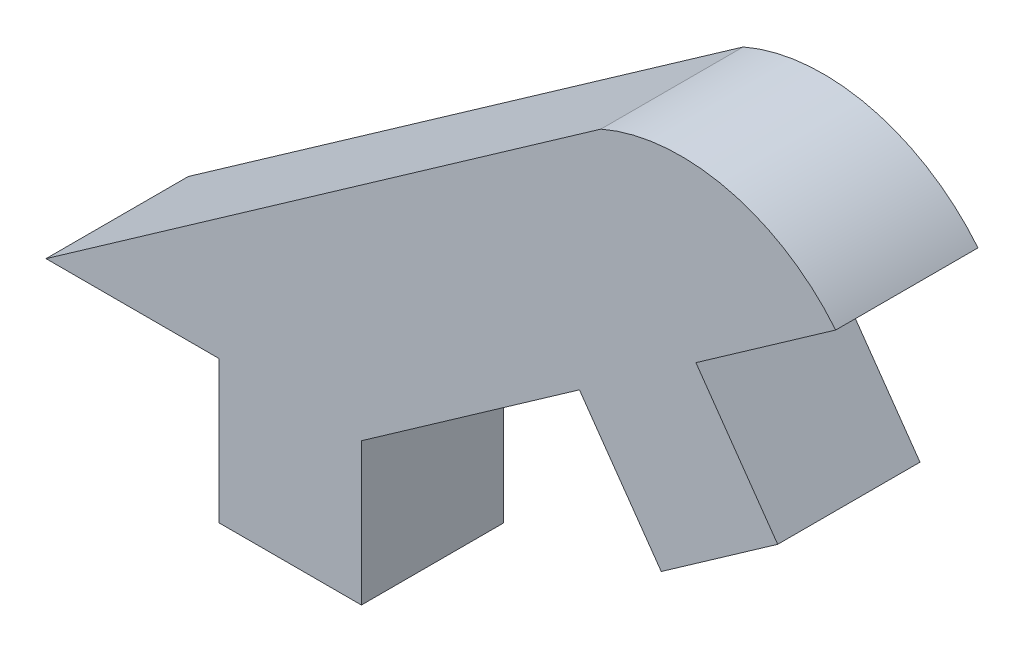
ISO-10303-21;
HEADER;
FILE_DESCRIPTION(('STEP AP214'),'2;1');
FILE_NAME('part.step','',(''),(''),'','','');
FILE_SCHEMA(('AUTOMOTIVE_DESIGN { 1 0 10303 214 1 1 1 1 }'));
ENDSEC;
DATA;
#1=APPLICATION_CONTEXT('core data for automotive mechanical design processes');
#2=APPLICATION_PROTOCOL_DEFINITION('international standard','automotive_design',2000,#1);
#3=PRODUCT_CONTEXT('',#1,'mechanical');
#4=PRODUCT('Part','Part','',(#3));
#5=PRODUCT_RELATED_PRODUCT_CATEGORY('part','',(#4));
#6=PRODUCT_DEFINITION_FORMATION('','',#4);
#7=PRODUCT_DEFINITION_CONTEXT('part definition',#1,'design');
#8=PRODUCT_DEFINITION('design','',#6,#7);
#9=PRODUCT_DEFINITION_SHAPE('','',#8);
#10=(LENGTH_UNIT() NAMED_UNIT(*) SI_UNIT(.MILLI.,.METRE.));
#11=(NAMED_UNIT(*) PLANE_ANGLE_UNIT() SI_UNIT($,.RADIAN.));
#12=(NAMED_UNIT(*) SI_UNIT($,.STERADIAN.) SOLID_ANGLE_UNIT());
#13=UNCERTAINTY_MEASURE_WITH_UNIT(LENGTH_MEASURE(1.E-05),#10,'distance_accuracy_value','');
#14=(GEOMETRIC_REPRESENTATION_CONTEXT(3) GLOBAL_UNCERTAINTY_ASSIGNED_CONTEXT((#13)) GLOBAL_UNIT_ASSIGNED_CONTEXT((#10,
#11,#12)) REPRESENTATION_CONTEXT('',''));
#15=CARTESIAN_POINT('',(0.,0.,0.));
#16=DIRECTION('',(0.,0.,1.));
#17=DIRECTION('',(1.,0.,0.));
#18=AXIS2_PLACEMENT_3D('',#15,#16,#17);
#19=CARTESIAN_POINT('',(26.7035857156091,0.,-1.524));
#20=DIRECTION('',(0.,1.,0.));
#21=DIRECTION('',(0.,0.,-1.));
#22=AXIS2_PLACEMENT_3D('',#19,#20,#21);
#23=PLANE('',#22);
#24=DIRECTION('',(1.,0.,0.));
#25=VECTOR('',#24,1.);
#26=CARTESIAN_POINT('',(26.7035857156091,0.,0.));
#27=LINE('',#26,#25);
#28=CARTESIAN_POINT('',(24.8496568898418,0.,0.));
#29=VERTEX_POINT('',#28);
#30=CARTESIAN_POINT('',(26.7035857156091,0.,0.));
#31=VERTEX_POINT('',#30);
#32=EDGE_CURVE('E148',#29,#31,#27,.T.);
#33=ORIENTED_EDGE('',*,*,#32,.F.);
#34=DIRECTION('',(0.,0.,1.));
#35=VECTOR('',#34,1.);
#36=CARTESIAN_POINT('',(24.8496568898418,0.,-1.524));
#37=LINE('',#36,#35);
#38=CARTESIAN_POINT('',(24.8496568898418,0.,-1.524));
#39=VERTEX_POINT('',#38);
#40=EDGE_CURVE('E147',#39,#29,#37,.T.);
#41=ORIENTED_EDGE('',*,*,#40,.F.);
#42=DIRECTION('',(1.,0.,0.));
#43=VECTOR('',#42,1.);
#44=CARTESIAN_POINT('',(26.7035857156091,0.,-1.524));
#45=LINE('',#44,#43);
#46=CARTESIAN_POINT('',(26.7035857156091,0.,-1.524));
#47=VERTEX_POINT('',#46);
#48=EDGE_CURVE('E175',#39,#47,#45,.T.);
#49=ORIENTED_EDGE('',*,*,#48,.T.);
#50=DIRECTION('',(0.,0.,1.));
#51=VECTOR('',#50,1.);
#52=CARTESIAN_POINT('',(26.7035857156091,0.,-1.524));
#53=LINE('',#52,#51);
#54=EDGE_CURVE('E11',#47,#31,#53,.T.);
#55=ORIENTED_EDGE('',*,*,#54,.T.);
#56=EDGE_LOOP('',(#33,#41,#49,#55));
#57=FACE_BOUND('',#56,.T.);
#58=ADVANCED_FACE('F34',(#57),#23,.F.);
#59=CARTESIAN_POINT('',(26.7035857156091,0.,-1.524));
#60=DIRECTION('',(1.,0.,0.));
#61=DIRECTION('',(0.,0.,1.));
#62=AXIS2_PLACEMENT_3D('',#59,#60,#61);
#63=PLANE('',#62);
#64=DIRECTION('',(0.,-1.,0.));
#65=VECTOR('',#64,1.);
#66=CARTESIAN_POINT('',(26.7035857156091,0.,0.));
#67=LINE('',#66,#65);
#68=CARTESIAN_POINT('',(26.7035857156091,-1.524,0.));
#69=VERTEX_POINT('',#68);
#70=EDGE_CURVE('E150',#31,#69,#67,.T.);
#71=ORIENTED_EDGE('',*,*,#70,.F.);
#72=ORIENTED_EDGE('',*,*,#54,.F.);
#73=DIRECTION('',(0.,-1.,0.));
#74=VECTOR('',#73,1.);
#75=CARTESIAN_POINT('',(26.7035857156091,0.,-1.524));
#76=LINE('',#75,#74);
#77=CARTESIAN_POINT('',(26.7035857156091,-1.524,-1.524));
#78=VERTEX_POINT('',#77);
#79=EDGE_CURVE('E97',#47,#78,#76,.T.);
#80=ORIENTED_EDGE('',*,*,#79,.T.);
#81=DIRECTION('',(0.,0.,1.));
#82=VECTOR('',#81,1.);
#83=CARTESIAN_POINT('',(26.7035857156091,-1.524,-1.524));
#84=LINE('',#83,#82);
#85=EDGE_CURVE('E42',#78,#69,#84,.T.);
#86=ORIENTED_EDGE('',*,*,#85,.T.);
#87=EDGE_LOOP('',(#71,#72,#80,#86));
#88=FACE_BOUND('',#87,.T.);
#89=ADVANCED_FACE('F196',(#88),#63,.F.);
#90=CARTESIAN_POINT('',(26.7035857156091,-1.524,-1.524));
#91=DIRECTION('',(0.,1.,0.));
#92=DIRECTION('',(0.,0.,-1.));
#93=AXIS2_PLACEMENT_3D('',#90,#91,#92);
#94=PLANE('',#93);
#95=DIRECTION('',(1.,0.,0.));
#96=VECTOR('',#95,1.);
#97=CARTESIAN_POINT('',(26.7035857156091,-1.524,0.));
#98=LINE('',#97,#96);
#99=CARTESIAN_POINT('',(28.2275857156091,-1.524,0.));
#100=VERTEX_POINT('',#99);
#101=EDGE_CURVE('E153',#69,#100,#98,.T.);
#102=ORIENTED_EDGE('',*,*,#101,.F.);
#103=ORIENTED_EDGE('',*,*,#85,.F.);
#104=DIRECTION('',(1.,0.,0.));
#105=VECTOR('',#104,1.);
#106=CARTESIAN_POINT('',(26.7035857156091,-1.524,-1.524));
#107=LINE('',#106,#105);
#108=CARTESIAN_POINT('',(28.2275857156091,-1.524,-1.524));
#109=VERTEX_POINT('',#108);
#110=EDGE_CURVE('E205',#78,#109,#107,.T.);
#111=ORIENTED_EDGE('',*,*,#110,.T.);
#112=DIRECTION('',(0.,0.,1.));
#113=VECTOR('',#112,1.);
#114=CARTESIAN_POINT('',(28.2275857156091,-1.524,-1.524));
#115=LINE('',#114,#113);
#116=EDGE_CURVE('E191',#109,#100,#115,.T.);
#117=ORIENTED_EDGE('',*,*,#116,.T.);
#118=EDGE_LOOP('',(#102,#103,#111,#117));
#119=FACE_BOUND('',#118,.T.);
#120=ADVANCED_FACE('F233',(#119),#94,.F.);
#121=CARTESIAN_POINT('',(28.2275857156091,-1.524,-1.524));
#122=DIRECTION('',(-1.,0.,0.));
#123=DIRECTION('',(0.,0.,-1.));
#124=AXIS2_PLACEMENT_3D('',#121,#122,#123);
#125=PLANE('',#124);
#126=DIRECTION('',(0.,1.,0.));
#127=VECTOR('',#126,1.);
#128=CARTESIAN_POINT('',(28.2275857156091,-1.524,0.));
#129=LINE('',#128,#127);
#130=CARTESIAN_POINT('',(28.2275857156091,0.,0.));
#131=VERTEX_POINT('',#130);
#132=EDGE_CURVE('E156',#100,#131,#129,.T.);
#133=ORIENTED_EDGE('',*,*,#132,.F.);
#134=ORIENTED_EDGE('',*,*,#116,.F.);
#135=DIRECTION('',(0.,1.,0.));
#136=VECTOR('',#135,1.);
#137=CARTESIAN_POINT('',(28.2275857156091,-1.524,-1.524));
#138=LINE('',#137,#136);
#139=CARTESIAN_POINT('',(28.2275857156091,0.,-1.524));
#140=VERTEX_POINT('',#139);
#141=EDGE_CURVE('E209',#109,#140,#138,.T.);
#142=ORIENTED_EDGE('',*,*,#141,.T.);
#143=DIRECTION('',(0.,0.,1.));
#144=VECTOR('',#143,1.);
#145=CARTESIAN_POINT('',(28.2275857156091,0.,-1.524));
#146=LINE('',#145,#144);
#147=EDGE_CURVE('E188',#140,#131,#146,.T.);
#148=ORIENTED_EDGE('',*,*,#147,.T.);
#149=EDGE_LOOP('',(#133,#134,#142,#148));
#150=FACE_BOUND('',#149,.T.);
#151=ADVANCED_FACE('F232',(#150),#125,.F.);
#152=CARTESIAN_POINT('',(28.2275857156091,0.,-1.524));
#153=DIRECTION('',(-0.574647327219023,0.818401154275843,0.));
#154=DIRECTION('',(-0.818401154275843,-0.574647327219023,0.));
#155=AXIS2_PLACEMENT_3D('',#152,#153,#154);
#156=PLANE('',#155);
#157=DIRECTION('',(0.818401154275843,0.574647327219023,0.));
#158=VECTOR('',#157,1.);
#159=CARTESIAN_POINT('',(28.2275857156091,0.,0.));
#160=LINE('',#159,#158);
#161=CARTESIAN_POINT('',(30.5627544392451,1.63965856918935,0.));
#162=VERTEX_POINT('',#161);
#163=EDGE_CURVE('E159',#131,#162,#160,.T.);
#164=ORIENTED_EDGE('',*,*,#163,.F.);
#165=ORIENTED_EDGE('',*,*,#147,.F.);
#166=DIRECTION('',(0.818401154275843,0.574647327219023,0.));
#167=VECTOR('',#166,1.);
#168=CARTESIAN_POINT('',(28.2275857156091,0.,-1.524));
#169=LINE('',#168,#167);
#170=CARTESIAN_POINT('',(30.5627544392451,1.63965856918935,-1.524));
#171=VERTEX_POINT('',#170);
#172=EDGE_CURVE('E212',#140,#171,#169,.T.);
#173=ORIENTED_EDGE('',*,*,#172,.T.);
#174=DIRECTION('',(0.,0.,1.));
#175=VECTOR('',#174,1.);
#176=CARTESIAN_POINT('',(30.5627544392451,1.63965856918935,-1.524));
#177=LINE('',#176,#175);
#178=EDGE_CURVE('E185',#171,#162,#177,.T.);
#179=ORIENTED_EDGE('',*,*,#178,.T.);
#180=EDGE_LOOP('',(#164,#165,#173,#179));
#181=FACE_BOUND('',#180,.T.);
#182=ADVANCED_FACE('F229',(#181),#156,.F.);
#183=CARTESIAN_POINT('',(30.5627544392451,1.63965856918935,-1.524));
#184=DIRECTION('',(0.818401154275843,0.574647327219023,0.));
#185=DIRECTION('',(-0.574647327219023,0.818401154275843,0.));
#186=AXIS2_PLACEMENT_3D('',#183,#184,#185);
#187=PLANE('',#186);
#188=DIRECTION('',(0.574647327219023,-0.818401154275843,0.));
#189=VECTOR('',#188,1.);
#190=CARTESIAN_POINT('',(30.5627544392451,1.63965856918935,0.));
#191=LINE('',#190,#189);
#192=CARTESIAN_POINT('',(31.4385169659268,0.392415210072967,0.));
#193=VERTEX_POINT('',#192);
#194=EDGE_CURVE('E162',#162,#193,#191,.T.);
#195=ORIENTED_EDGE('',*,*,#194,.F.);
#196=ORIENTED_EDGE('',*,*,#178,.F.);
#197=DIRECTION('',(0.574647327219023,-0.818401154275843,0.));
#198=VECTOR('',#197,1.);
#199=CARTESIAN_POINT('',(30.5627544392451,1.63965856918935,-1.524));
#200=LINE('',#199,#198);
#201=CARTESIAN_POINT('',(31.4385169659268,0.392415210072967,-1.524));
#202=VERTEX_POINT('',#201);
#203=EDGE_CURVE('E215',#171,#202,#200,.T.);
#204=ORIENTED_EDGE('',*,*,#203,.T.);
#205=DIRECTION('',(0.,0.,1.));
#206=VECTOR('',#205,1.);
#207=CARTESIAN_POINT('',(31.4385169659268,0.392415210072967,-1.524));
#208=LINE('',#207,#206);
#209=EDGE_CURVE('E182',#202,#193,#208,.T.);
#210=ORIENTED_EDGE('',*,*,#209,.T.);
#211=EDGE_LOOP('',(#195,#196,#204,#210));
#212=FACE_BOUND('',#211,.T.);
#213=ADVANCED_FACE('F226',(#212),#187,.F.);
#214=CARTESIAN_POINT('',(31.4385169659268,0.392415210072967,-1.524));
#215=DIRECTION('',(-0.574647327219024,0.818401154275843,0.));
#216=DIRECTION('',(-0.818401154275843,-0.574647327219024,0.));
#217=AXIS2_PLACEMENT_3D('',#214,#215,#216);
#218=PLANE('',#217);
#219=DIRECTION('',(0.818401154275843,0.574647327219024,0.));
#220=VECTOR('',#219,1.);
#221=CARTESIAN_POINT('',(31.4385169659268,0.392415210072967,0.));
#222=LINE('',#221,#220);
#223=CARTESIAN_POINT('',(32.6857603250432,1.26817773675476,0.));
#224=VERTEX_POINT('',#223);
#225=EDGE_CURVE('E165',#193,#224,#222,.T.);
#226=ORIENTED_EDGE('',*,*,#225,.F.);
#227=ORIENTED_EDGE('',*,*,#209,.F.);
#228=DIRECTION('',(0.818401154275843,0.574647327219024,0.));
#229=VECTOR('',#228,1.);
#230=CARTESIAN_POINT('',(31.4385169659268,0.392415210072967,-1.524));
#231=LINE('',#230,#229);
#232=CARTESIAN_POINT('',(32.6857603250432,1.26817773675476,-1.524));
#233=VERTEX_POINT('',#232);
#234=EDGE_CURVE('E142',#202,#233,#231,.T.);
#235=ORIENTED_EDGE('',*,*,#234,.T.);
#236=DIRECTION('',(0.,0.,1.));
#237=VECTOR('',#236,1.);
#238=CARTESIAN_POINT('',(32.6857603250432,1.26817773675476,-1.524));
#239=LINE('',#238,#237);
#240=EDGE_CURVE('E179',#233,#224,#239,.T.);
#241=ORIENTED_EDGE('',*,*,#240,.T.);
#242=EDGE_LOOP('',(#226,#227,#235,#241));
#243=FACE_BOUND('',#242,.T.);
#244=ADVANCED_FACE('F220',(#243),#218,.F.);
#245=CARTESIAN_POINT('',(32.6857603250432,1.26817773675476,-1.524));
#246=DIRECTION('',(-0.818401154275844,-0.574647327219022,0.));
#247=DIRECTION('',(0.574647327219022,-0.818401154275844,0.));
#248=AXIS2_PLACEMENT_3D('',#245,#246,#247);
#249=PLANE('',#248);
#250=DIRECTION('',(-0.574647327219022,0.818401154275844,0.));
#251=VECTOR('',#250,1.);
#252=CARTESIAN_POINT('',(32.6857603250432,1.26817773675476,0.));
#253=LINE('',#252,#251);
#254=CARTESIAN_POINT('',(31.8099977983614,2.51542109587115,0.));
#255=VERTEX_POINT('',#254);
#256=EDGE_CURVE('E168',#224,#255,#253,.T.);
#257=ORIENTED_EDGE('',*,*,#256,.F.);
#258=ORIENTED_EDGE('',*,*,#240,.F.);
#259=DIRECTION('',(-0.574647327219022,0.818401154275844,0.));
#260=VECTOR('',#259,1.);
#261=CARTESIAN_POINT('',(32.6857603250432,1.26817773675476,-1.524));
#262=LINE('',#261,#260);
#263=CARTESIAN_POINT('',(31.8099977983614,2.51542109587115,-1.524));
#264=VERTEX_POINT('',#263);
#265=EDGE_CURVE('E140',#233,#264,#262,.T.);
#266=ORIENTED_EDGE('',*,*,#265,.T.);
#267=DIRECTION('',(0.,0.,1.));
#268=VECTOR('',#267,1.);
#269=CARTESIAN_POINT('',(31.8099977983614,2.51542109587115,-1.524));
#270=LINE('',#269,#268);
#271=EDGE_CURVE('E134',#264,#255,#270,.T.);
#272=ORIENTED_EDGE('',*,*,#271,.T.);
#273=EDGE_LOOP('',(#257,#258,#266,#272));
#274=FACE_BOUND('',#273,.T.);
#275=ADVANCED_FACE('F224',(#274),#249,.F.);
#276=CARTESIAN_POINT('',(31.8099977983614,2.51542109587115,-1.524));
#277=DIRECTION('',(-0.574647327219024,0.818401154275843,0.));
#278=DIRECTION('',(-0.818401154275843,-0.574647327219024,0.));
#279=AXIS2_PLACEMENT_3D('',#276,#277,#278);
#280=PLANE('',#279);
#281=DIRECTION('',(0.818401154275843,0.574647327219024,0.));
#282=VECTOR('',#281,1.);
#283=CARTESIAN_POINT('',(31.8099977983614,2.51542109587115,0.));
#284=LINE('',#283,#282);
#285=CARTESIAN_POINT('',(33.3069658175326,3.56652991537204,0.));
#286=VERTEX_POINT('',#285);
#287=EDGE_CURVE('E171',#255,#286,#284,.T.);
#288=ORIENTED_EDGE('',*,*,#287,.F.);
#289=ORIENTED_EDGE('',*,*,#271,.F.);
#290=DIRECTION('',(0.818401154275843,0.574647327219024,0.));
#291=VECTOR('',#290,1.);
#292=CARTESIAN_POINT('',(31.8099977983614,2.51542109587115,-1.524));
#293=LINE('',#292,#291);
#294=CARTESIAN_POINT('',(33.3069658175326,3.56652991537204,-1.524));
#295=VERTEX_POINT('',#294);
#296=EDGE_CURVE('E124',#264,#295,#293,.T.);
#297=ORIENTED_EDGE('',*,*,#296,.T.);
#298=DIRECTION('',(0.,0.,1.));
#299=VECTOR('',#298,1.);
#300=CARTESIAN_POINT('',(33.3069658175326,3.56652991537204,-1.524));
#301=LINE('',#300,#299);
#302=EDGE_CURVE('E129',#295,#286,#301,.T.);
#303=ORIENTED_EDGE('',*,*,#302,.T.);
#304=EDGE_LOOP('',(#288,#289,#297,#303));
#305=FACE_BOUND('',#304,.T.);
#306=ADVANCED_FACE('F137',(#305),#280,.F.);
#307=CARTESIAN_POINT('',(31.6507784793167,2.21503572462214,-1.524));
#308=DIRECTION('',(0.,0.,1.));
#309=DIRECTION('',(-1.,0.,0.));
#310=AXIS2_PLACEMENT_3D('',#307,#308,#309);
#311=CYLINDRICAL_SURFACE('',#310,2.13763725802519);
#312=CARTESIAN_POINT('',(31.6507784793167,2.21503572462214,0.));
#313=DIRECTION('',(0.,0.,1.));
#314=DIRECTION('',(1.,0.,0.));
#315=AXIS2_PLACEMENT_3D('',#312,#313,#314);
#316=CIRCLE('',#315,2.13763725802519);
#317=CARTESIAN_POINT('',(30.7924423059396,4.17277729601755,0.));
#318=VERTEX_POINT('',#317);
#319=EDGE_CURVE('E131',#286,#318,#316,.T.);
#320=ORIENTED_EDGE('',*,*,#319,.F.);
#321=ORIENTED_EDGE('',*,*,#302,.F.);
#322=CARTESIAN_POINT('',(31.6507784793167,2.21503572462214,-1.524));
#323=DIRECTION('',(0.,0.,1.));
#324=DIRECTION('',(1.,0.,0.));
#325=AXIS2_PLACEMENT_3D('',#322,#323,#324);
#326=CIRCLE('',#325,2.13763725802519);
#327=CARTESIAN_POINT('',(30.7924423059396,4.17277729601755,-1.524));
#328=VERTEX_POINT('',#327);
#329=EDGE_CURVE('E120',#295,#328,#326,.T.);
#330=ORIENTED_EDGE('',*,*,#329,.T.);
#331=DIRECTION('',(0.,0.,1.));
#332=VECTOR('',#331,1.);
#333=CARTESIAN_POINT('',(30.7924423059396,4.17277729601755,-1.524));
#334=LINE('',#333,#332);
#335=EDGE_CURVE('E135',#328,#318,#334,.T.);
#336=ORIENTED_EDGE('',*,*,#335,.T.);
#337=EDGE_LOOP('',(#320,#321,#330,#336));
#338=FACE_BOUND('',#337,.T.);
#339=ADVANCED_FACE('F130',(#338),#311,.T.);
#340=CARTESIAN_POINT('',(24.8496568898418,0.,-1.524));
#341=DIRECTION('',(0.574647327219023,-0.818401154275843,0.));
#342=DIRECTION('',(0.818401154275843,0.574647327219023,0.));
#343=AXIS2_PLACEMENT_3D('',#340,#341,#342);
#344=PLANE('',#343);
#345=DIRECTION('',(-0.818401154275843,-0.574647327219023,0.));
#346=VECTOR('',#345,1.);
#347=CARTESIAN_POINT('',(24.8496568898418,0.,0.));
#348=LINE('',#347,#346);
#349=EDGE_CURVE('E85',#318,#29,#348,.T.);
#350=ORIENTED_EDGE('',*,*,#349,.F.);
#351=ORIENTED_EDGE('',*,*,#335,.F.);
#352=DIRECTION('',(-0.818401154275843,-0.574647327219023,0.));
#353=VECTOR('',#352,1.);
#354=CARTESIAN_POINT('',(24.8496568898418,0.,-1.524));
#355=LINE('',#354,#353);
#356=EDGE_CURVE('E50',#328,#39,#355,.T.);
#357=ORIENTED_EDGE('',*,*,#356,.T.);
#358=ORIENTED_EDGE('',*,*,#40,.T.);
#359=EDGE_LOOP('',(#350,#351,#357,#358));
#360=FACE_BOUND('',#359,.T.);
#361=ADVANCED_FACE('F307',(#360),#344,.F.);
#362=CARTESIAN_POINT('',(31.6507784793167,2.21503572462214,-1.524));
#363=DIRECTION('',(0.,0.,-1.));
#364=DIRECTION('',(1.,0.,0.));
#365=AXIS2_PLACEMENT_3D('',#362,#363,#364);
#366=PLANE('',#365);
#367=ORIENTED_EDGE('',*,*,#48,.F.);
#368=ORIENTED_EDGE('',*,*,#356,.F.);
#369=ORIENTED_EDGE('',*,*,#329,.F.);
#370=ORIENTED_EDGE('',*,*,#296,.F.);
#371=ORIENTED_EDGE('',*,*,#265,.F.);
#372=ORIENTED_EDGE('',*,*,#234,.F.);
#373=ORIENTED_EDGE('',*,*,#203,.F.);
#374=ORIENTED_EDGE('',*,*,#172,.F.);
#375=ORIENTED_EDGE('',*,*,#141,.F.);
#376=ORIENTED_EDGE('',*,*,#110,.F.);
#377=ORIENTED_EDGE('',*,*,#79,.F.);
#378=EDGE_LOOP('',(#367,#368,#369,#370,#371,#372,#373,#374,#375,#376,#377));
#379=FACE_BOUND('',#378,.T.);
#380=ADVANCED_FACE('F122',(#379),#366,.T.);
#381=CARTESIAN_POINT('',(31.6507784793167,2.21503572462214,0.));
#382=DIRECTION('',(0.,0.,-1.));
#383=DIRECTION('',(1.,0.,0.));
#384=AXIS2_PLACEMENT_3D('',#381,#382,#383);
#385=PLANE('',#384);
#386=ORIENTED_EDGE('',*,*,#32,.T.);
#387=ORIENTED_EDGE('',*,*,#70,.T.);
#388=ORIENTED_EDGE('',*,*,#101,.T.);
#389=ORIENTED_EDGE('',*,*,#132,.T.);
#390=ORIENTED_EDGE('',*,*,#163,.T.);
#391=ORIENTED_EDGE('',*,*,#194,.T.);
#392=ORIENTED_EDGE('',*,*,#225,.T.);
#393=ORIENTED_EDGE('',*,*,#256,.T.);
#394=ORIENTED_EDGE('',*,*,#287,.T.);
#395=ORIENTED_EDGE('',*,*,#319,.T.);
#396=ORIENTED_EDGE('',*,*,#349,.T.);
#397=EDGE_LOOP('',(#386,#387,#388,#389,#390,#391,#392,#393,#394,#395,#396));
#398=FACE_BOUND('',#397,.T.);
#399=ADVANCED_FACE('F199',(#398),#385,.F.);
#400=CLOSED_SHELL('',(#58,#89,#120,#151,#182,#213,#244,#275,#306,#339,#361,#380,#399));
#401=MANIFOLD_SOLID_BREP('B2',#400);
#402=ADVANCED_BREP_SHAPE_REPRESENTATION('',(#18,#401),#14);
#403=SHAPE_DEFINITION_REPRESENTATION(#9,#402);
ENDSEC;
END-ISO-10303-21;
